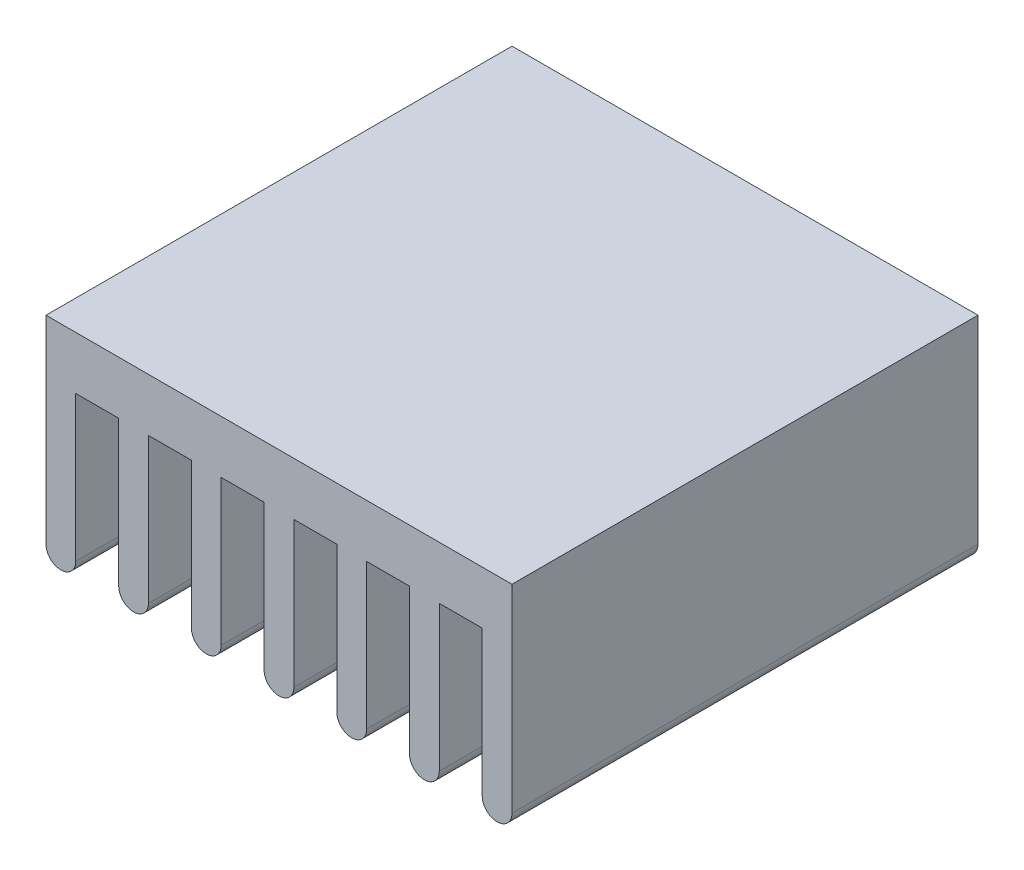
ISO-10303-21;
HEADER;
FILE_DESCRIPTION(('STEP AP214'),'2;1');
FILE_NAME('part.step','',(''),(''),'','','');
FILE_SCHEMA(('AUTOMOTIVE_DESIGN { 1 0 10303 214 1 1 1 1 }'));
ENDSEC;
DATA;
#1=APPLICATION_CONTEXT('core data for automotive mechanical design processes');
#2=APPLICATION_PROTOCOL_DEFINITION('international standard','automotive_design',2000,#1);
#3=PRODUCT_CONTEXT('',#1,'mechanical');
#4=PRODUCT('Part','Part','',(#3));
#5=PRODUCT_RELATED_PRODUCT_CATEGORY('part','',(#4));
#6=PRODUCT_DEFINITION_FORMATION('','',#4);
#7=PRODUCT_DEFINITION_CONTEXT('part definition',#1,'design');
#8=PRODUCT_DEFINITION('design','',#6,#7);
#9=PRODUCT_DEFINITION_SHAPE('','',#8);
#10=(LENGTH_UNIT() NAMED_UNIT(*) SI_UNIT(.MILLI.,.METRE.));
#11=(NAMED_UNIT(*) PLANE_ANGLE_UNIT() SI_UNIT($,.RADIAN.));
#12=(NAMED_UNIT(*) SI_UNIT($,.STERADIAN.) SOLID_ANGLE_UNIT());
#13=UNCERTAINTY_MEASURE_WITH_UNIT(LENGTH_MEASURE(1.E-05),#10,'distance_accuracy_value','');
#14=(GEOMETRIC_REPRESENTATION_CONTEXT(3) GLOBAL_UNCERTAINTY_ASSIGNED_CONTEXT((#13)) GLOBAL_UNIT_ASSIGNED_CONTEXT((#10,
#11,#12)) REPRESENTATION_CONTEXT('',''));
#15=CARTESIAN_POINT('',(0.,0.,0.));
#16=DIRECTION('',(0.,0.,1.));
#17=DIRECTION('',(1.,0.,0.));
#18=AXIS2_PLACEMENT_3D('',#15,#16,#17);
#19=CARTESIAN_POINT('',(0.,0.,14.1));
#20=DIRECTION('',(1.,0.,0.));
#21=DIRECTION('',(0.,1.,0.));
#22=AXIS2_PLACEMENT_3D('',#19,#20,#21);
#23=PLANE('',#22);
#24=DIRECTION('',(0.,-1.,0.));
#25=VECTOR('',#24,1.);
#26=CARTESIAN_POINT('',(0.,0.,0.));
#27=LINE('',#26,#25);
#28=CARTESIAN_POINT('',(0.,0.,0.));
#29=VERTEX_POINT('',#28);
#30=CARTESIAN_POINT('',(0.,-6.,0.));
#31=VERTEX_POINT('',#30);
#32=EDGE_CURVE('E249',#29,#31,#27,.T.);
#33=ORIENTED_EDGE('',*,*,#32,.T.);
#34=DIRECTION('',(0.,0.,-1.));
#35=VECTOR('',#34,1.);
#36=CARTESIAN_POINT('',(0.,-6.,14.1));
#37=LINE('',#36,#35);
#38=CARTESIAN_POINT('',(0.,-6.,14.1));
#39=VERTEX_POINT('',#38);
#40=EDGE_CURVE('E11',#39,#31,#37,.T.);
#41=ORIENTED_EDGE('',*,*,#40,.F.);
#42=DIRECTION('',(0.,-1.,0.));
#43=VECTOR('',#42,1.);
#44=CARTESIAN_POINT('',(0.,0.,14.1));
#45=LINE('',#44,#43);
#46=CARTESIAN_POINT('',(0.,0.,14.1));
#47=VERTEX_POINT('',#46);
#48=EDGE_CURVE('E303',#47,#39,#45,.T.);
#49=ORIENTED_EDGE('',*,*,#48,.F.);
#50=DIRECTION('',(0.,0.,-1.));
#51=VECTOR('',#50,1.);
#52=CARTESIAN_POINT('',(0.,0.,14.1));
#53=LINE('',#52,#51);
#54=EDGE_CURVE('E245',#47,#29,#53,.T.);
#55=ORIENTED_EDGE('',*,*,#54,.T.);
#56=EDGE_LOOP('',(#33,#41,#49,#55));
#57=FACE_BOUND('',#56,.T.);
#58=ADVANCED_FACE('F33',(#57),#23,.F.);
#59=CARTESIAN_POINT('',(0.450000000000001,-6.,14.1));
#60=DIRECTION('',(0.,0.,-1.));
#61=DIRECTION('',(-1.,0.,0.));
#62=AXIS2_PLACEMENT_3D('',#59,#60,#61);
#63=CYLINDRICAL_SURFACE('',#62,0.45);
#64=CARTESIAN_POINT('',(0.450000000000001,-6.,0.));
#65=DIRECTION('',(0.,0.,1.));
#66=DIRECTION('',(1.,0.,0.));
#67=AXIS2_PLACEMENT_3D('',#64,#65,#66);
#68=CIRCLE('',#67,0.45);
#69=CARTESIAN_POINT('',(0.900000000000001,-6.,0.));
#70=VERTEX_POINT('',#69);
#71=EDGE_CURVE('E252',#31,#70,#68,.T.);
#72=ORIENTED_EDGE('',*,*,#71,.T.);
#73=DIRECTION('',(0.,0.,-1.));
#74=VECTOR('',#73,1.);
#75=CARTESIAN_POINT('',(0.900000000000001,-6.,14.1));
#76=LINE('',#75,#74);
#77=CARTESIAN_POINT('',(0.900000000000001,-6.,14.1));
#78=VERTEX_POINT('',#77);
#79=EDGE_CURVE('E41',#78,#70,#76,.T.);
#80=ORIENTED_EDGE('',*,*,#79,.F.);
#81=CARTESIAN_POINT('',(0.450000000000001,-6.,14.1));
#82=DIRECTION('',(0.,0.,1.));
#83=DIRECTION('',(1.,0.,0.));
#84=AXIS2_PLACEMENT_3D('',#81,#82,#83);
#85=CIRCLE('',#84,0.45);
#86=EDGE_CURVE('E152',#39,#78,#85,.T.);
#87=ORIENTED_EDGE('',*,*,#86,.F.);
#88=ORIENTED_EDGE('',*,*,#40,.T.);
#89=EDGE_LOOP('',(#72,#80,#87,#88));
#90=FACE_BOUND('',#89,.T.);
#91=ADVANCED_FACE('F461',(#90),#63,.T.);
#92=CARTESIAN_POINT('',(0.9,-1.6,14.1));
#93=DIRECTION('',(-1.,0.,0.));
#94=DIRECTION('',(0.,-1.,0.));
#95=AXIS2_PLACEMENT_3D('',#92,#93,#94);
#96=PLANE('',#95);
#97=DIRECTION('',(0.,1.,0.));
#98=VECTOR('',#97,1.);
#99=CARTESIAN_POINT('',(0.9,-1.6,0.));
#100=LINE('',#99,#98);
#101=CARTESIAN_POINT('',(0.9,-1.6,0.));
#102=VERTEX_POINT('',#101);
#103=EDGE_CURVE('E254',#70,#102,#100,.T.);
#104=ORIENTED_EDGE('',*,*,#103,.T.);
#105=DIRECTION('',(0.,0.,-1.));
#106=VECTOR('',#105,1.);
#107=CARTESIAN_POINT('',(0.9,-1.6,14.1));
#108=LINE('',#107,#106);
#109=CARTESIAN_POINT('',(0.9,-1.6,14.1));
#110=VERTEX_POINT('',#109);
#111=EDGE_CURVE('E370',#110,#102,#108,.T.);
#112=ORIENTED_EDGE('',*,*,#111,.F.);
#113=DIRECTION('',(0.,1.,0.));
#114=VECTOR('',#113,1.);
#115=CARTESIAN_POINT('',(0.9,-1.6,14.1));
#116=LINE('',#115,#114);
#117=EDGE_CURVE('E378',#78,#110,#116,.T.);
#118=ORIENTED_EDGE('',*,*,#117,.F.);
#119=ORIENTED_EDGE('',*,*,#79,.T.);
#120=EDGE_LOOP('',(#104,#112,#118,#119));
#121=FACE_BOUND('',#120,.T.);
#122=ADVANCED_FACE('F376',(#121),#96,.F.);
#123=CARTESIAN_POINT('',(0.9,-1.6,14.1));
#124=DIRECTION('',(0.,1.,0.));
#125=DIRECTION('',(0.,0.,1.));
#126=AXIS2_PLACEMENT_3D('',#123,#124,#125);
#127=PLANE('',#126);
#128=DIRECTION('',(1.,0.,0.));
#129=VECTOR('',#128,1.);
#130=CARTESIAN_POINT('',(0.9,-1.6,0.));
#131=LINE('',#130,#129);
#132=CARTESIAN_POINT('',(2.2,-1.6,0.));
#133=VERTEX_POINT('',#132);
#134=EDGE_CURVE('E256',#102,#133,#131,.T.);
#135=ORIENTED_EDGE('',*,*,#134,.T.);
#136=DIRECTION('',(0.,0.,-1.));
#137=VECTOR('',#136,1.);
#138=CARTESIAN_POINT('',(2.2,-1.6,14.1));
#139=LINE('',#138,#137);
#140=CARTESIAN_POINT('',(2.2,-1.6,14.1));
#141=VERTEX_POINT('',#140);
#142=EDGE_CURVE('E367',#141,#133,#139,.T.);
#143=ORIENTED_EDGE('',*,*,#142,.F.);
#144=DIRECTION('',(1.,0.,0.));
#145=VECTOR('',#144,1.);
#146=CARTESIAN_POINT('',(0.9,-1.6,14.1));
#147=LINE('',#146,#145);
#148=EDGE_CURVE('E396',#110,#141,#147,.T.);
#149=ORIENTED_EDGE('',*,*,#148,.F.);
#150=ORIENTED_EDGE('',*,*,#111,.T.);
#151=EDGE_LOOP('',(#135,#143,#149,#150));
#152=FACE_BOUND('',#151,.T.);
#153=ADVANCED_FACE('F387',(#152),#127,.F.);
#154=CARTESIAN_POINT('',(2.2,-1.6,14.1));
#155=DIRECTION('',(1.,0.,0.));
#156=DIRECTION('',(0.,1.,0.));
#157=AXIS2_PLACEMENT_3D('',#154,#155,#156);
#158=PLANE('',#157);
#159=DIRECTION('',(0.,-1.,0.));
#160=VECTOR('',#159,1.);
#161=CARTESIAN_POINT('',(2.2,-1.6,0.));
#162=LINE('',#161,#160);
#163=CARTESIAN_POINT('',(2.2,-6.,0.));
#164=VERTEX_POINT('',#163);
#165=EDGE_CURVE('E258',#133,#164,#162,.T.);
#166=ORIENTED_EDGE('',*,*,#165,.T.);
#167=DIRECTION('',(0.,0.,-1.));
#168=VECTOR('',#167,1.);
#169=CARTESIAN_POINT('',(2.2,-6.,14.1));
#170=LINE('',#169,#168);
#171=CARTESIAN_POINT('',(2.2,-6.,14.1));
#172=VERTEX_POINT('',#171);
#173=EDGE_CURVE('E364',#172,#164,#170,.T.);
#174=ORIENTED_EDGE('',*,*,#173,.F.);
#175=DIRECTION('',(0.,-1.,0.));
#176=VECTOR('',#175,1.);
#177=CARTESIAN_POINT('',(2.2,-1.6,14.1));
#178=LINE('',#177,#176);
#179=EDGE_CURVE('E393',#141,#172,#178,.T.);
#180=ORIENTED_EDGE('',*,*,#179,.F.);
#181=ORIENTED_EDGE('',*,*,#142,.T.);
#182=EDGE_LOOP('',(#166,#174,#180,#181));
#183=FACE_BOUND('',#182,.T.);
#184=ADVANCED_FACE('F391',(#183),#158,.F.);
#185=CARTESIAN_POINT('',(2.65,-6.,14.1));
#186=DIRECTION('',(0.,0.,-1.));
#187=DIRECTION('',(-1.,0.,0.));
#188=AXIS2_PLACEMENT_3D('',#185,#186,#187);
#189=CYLINDRICAL_SURFACE('',#188,0.45);
#190=CARTESIAN_POINT('',(2.65,-6.,0.));
#191=DIRECTION('',(0.,0.,1.));
#192=DIRECTION('',(1.,0.,0.));
#193=AXIS2_PLACEMENT_3D('',#190,#191,#192);
#194=CIRCLE('',#193,0.45);
#195=CARTESIAN_POINT('',(3.1,-6.,0.));
#196=VERTEX_POINT('',#195);
#197=EDGE_CURVE('E260',#164,#196,#194,.T.);
#198=ORIENTED_EDGE('',*,*,#197,.T.);
#199=DIRECTION('',(0.,0.,-1.));
#200=VECTOR('',#199,1.);
#201=CARTESIAN_POINT('',(3.1,-6.,14.1));
#202=LINE('',#201,#200);
#203=CARTESIAN_POINT('',(3.1,-6.,14.1));
#204=VERTEX_POINT('',#203);
#205=EDGE_CURVE('E361',#204,#196,#202,.T.);
#206=ORIENTED_EDGE('',*,*,#205,.F.);
#207=CARTESIAN_POINT('',(2.65,-6.,14.1));
#208=DIRECTION('',(0.,0.,1.));
#209=DIRECTION('',(1.,0.,0.));
#210=AXIS2_PLACEMENT_3D('',#207,#208,#209);
#211=CIRCLE('',#210,0.45);
#212=EDGE_CURVE('E395',#172,#204,#211,.T.);
#213=ORIENTED_EDGE('',*,*,#212,.F.);
#214=ORIENTED_EDGE('',*,*,#173,.T.);
#215=EDGE_LOOP('',(#198,#206,#213,#214));
#216=FACE_BOUND('',#215,.T.);
#217=ADVANCED_FACE('F474',(#216),#189,.T.);
#218=CARTESIAN_POINT('',(3.1,-6.,14.1));
#219=DIRECTION('',(-1.,0.,0.));
#220=DIRECTION('',(0.,0.,1.));
#221=AXIS2_PLACEMENT_3D('',#218,#219,#220);
#222=PLANE('',#221);
#223=DIRECTION('',(0.,1.,0.));
#224=VECTOR('',#223,1.);
#225=CARTESIAN_POINT('',(3.1,-6.,0.));
#226=LINE('',#225,#224);
#227=CARTESIAN_POINT('',(3.1,-1.6,0.));
#228=VERTEX_POINT('',#227);
#229=EDGE_CURVE('E262',#196,#228,#226,.T.);
#230=ORIENTED_EDGE('',*,*,#229,.T.);
#231=DIRECTION('',(0.,0.,-1.));
#232=VECTOR('',#231,1.);
#233=CARTESIAN_POINT('',(3.1,-1.6,14.1));
#234=LINE('',#233,#232);
#235=CARTESIAN_POINT('',(3.1,-1.6,14.1));
#236=VERTEX_POINT('',#235);
#237=EDGE_CURVE('E358',#236,#228,#234,.T.);
#238=ORIENTED_EDGE('',*,*,#237,.F.);
#239=DIRECTION('',(0.,1.,0.));
#240=VECTOR('',#239,1.);
#241=CARTESIAN_POINT('',(3.1,-6.,14.1));
#242=LINE('',#241,#240);
#243=EDGE_CURVE('E398',#204,#236,#242,.T.);
#244=ORIENTED_EDGE('',*,*,#243,.F.);
#245=ORIENTED_EDGE('',*,*,#205,.T.);
#246=EDGE_LOOP('',(#230,#238,#244,#245));
#247=FACE_BOUND('',#246,.T.);
#248=ADVANCED_FACE('F477',(#247),#222,.F.);
#249=CARTESIAN_POINT('',(3.1,-1.6,14.1));
#250=DIRECTION('',(0.,1.,0.));
#251=DIRECTION('',(0.,0.,1.));
#252=AXIS2_PLACEMENT_3D('',#249,#250,#251);
#253=PLANE('',#252);
#254=DIRECTION('',(1.,0.,0.));
#255=VECTOR('',#254,1.);
#256=CARTESIAN_POINT('',(3.1,-1.6,0.));
#257=LINE('',#256,#255);
#258=CARTESIAN_POINT('',(4.4,-1.6,0.));
#259=VERTEX_POINT('',#258);
#260=EDGE_CURVE('E264',#228,#259,#257,.T.);
#261=ORIENTED_EDGE('',*,*,#260,.T.);
#262=DIRECTION('',(0.,0.,-1.));
#263=VECTOR('',#262,1.);
#264=CARTESIAN_POINT('',(4.4,-1.6,14.1));
#265=LINE('',#264,#263);
#266=CARTESIAN_POINT('',(4.4,-1.6,14.1));
#267=VERTEX_POINT('',#266);
#268=EDGE_CURVE('E355',#267,#259,#265,.T.);
#269=ORIENTED_EDGE('',*,*,#268,.F.);
#270=DIRECTION('',(1.,0.,0.));
#271=VECTOR('',#270,1.);
#272=CARTESIAN_POINT('',(3.1,-1.6,14.1));
#273=LINE('',#272,#271);
#274=EDGE_CURVE('E404',#236,#267,#273,.T.);
#275=ORIENTED_EDGE('',*,*,#274,.F.);
#276=ORIENTED_EDGE('',*,*,#237,.T.);
#277=EDGE_LOOP('',(#261,#269,#275,#276));
#278=FACE_BOUND('',#277,.T.);
#279=ADVANCED_FACE('F481',(#278),#253,.F.);
#280=CARTESIAN_POINT('',(4.4,-1.6,14.1));
#281=DIRECTION('',(1.,0.,0.));
#282=DIRECTION('',(0.,1.,0.));
#283=AXIS2_PLACEMENT_3D('',#280,#281,#282);
#284=PLANE('',#283);
#285=DIRECTION('',(0.,-1.,0.));
#286=VECTOR('',#285,1.);
#287=CARTESIAN_POINT('',(4.4,-1.6,0.));
#288=LINE('',#287,#286);
#289=CARTESIAN_POINT('',(4.4,-6.,0.));
#290=VERTEX_POINT('',#289);
#291=EDGE_CURVE('E266',#259,#290,#288,.T.);
#292=ORIENTED_EDGE('',*,*,#291,.T.);
#293=DIRECTION('',(0.,0.,-1.));
#294=VECTOR('',#293,1.);
#295=CARTESIAN_POINT('',(4.4,-6.,14.1));
#296=LINE('',#295,#294);
#297=CARTESIAN_POINT('',(4.4,-6.,14.1));
#298=VERTEX_POINT('',#297);
#299=EDGE_CURVE('E352',#298,#290,#296,.T.);
#300=ORIENTED_EDGE('',*,*,#299,.F.);
#301=DIRECTION('',(0.,-1.,0.));
#302=VECTOR('',#301,1.);
#303=CARTESIAN_POINT('',(4.4,-1.6,14.1));
#304=LINE('',#303,#302);
#305=EDGE_CURVE('E406',#267,#298,#304,.T.);
#306=ORIENTED_EDGE('',*,*,#305,.F.);
#307=ORIENTED_EDGE('',*,*,#268,.T.);
#308=EDGE_LOOP('',(#292,#300,#306,#307));
#309=FACE_BOUND('',#308,.T.);
#310=ADVANCED_FACE('F485',(#309),#284,.F.);
#311=CARTESIAN_POINT('',(4.85,-6.,14.1));
#312=DIRECTION('',(0.,0.,-1.));
#313=DIRECTION('',(-1.,0.,0.));
#314=AXIS2_PLACEMENT_3D('',#311,#312,#313);
#315=CYLINDRICAL_SURFACE('',#314,0.449999999999999);
#316=CARTESIAN_POINT('',(4.85,-6.,0.));
#317=DIRECTION('',(0.,0.,1.));
#318=DIRECTION('',(1.,0.,0.));
#319=AXIS2_PLACEMENT_3D('',#316,#317,#318);
#320=CIRCLE('',#319,0.449999999999999);
#321=CARTESIAN_POINT('',(5.3,-6.,0.));
#322=VERTEX_POINT('',#321);
#323=EDGE_CURVE('E268',#290,#322,#320,.T.);
#324=ORIENTED_EDGE('',*,*,#323,.T.);
#325=DIRECTION('',(0.,0.,-1.));
#326=VECTOR('',#325,1.);
#327=CARTESIAN_POINT('',(5.3,-6.,14.1));
#328=LINE('',#327,#326);
#329=CARTESIAN_POINT('',(5.3,-6.,14.1));
#330=VERTEX_POINT('',#329);
#331=EDGE_CURVE('E349',#330,#322,#328,.T.);
#332=ORIENTED_EDGE('',*,*,#331,.F.);
#333=CARTESIAN_POINT('',(4.85,-6.,14.1));
#334=DIRECTION('',(0.,0.,1.));
#335=DIRECTION('',(1.,0.,0.));
#336=AXIS2_PLACEMENT_3D('',#333,#334,#335);
#337=CIRCLE('',#336,0.449999999999999);
#338=EDGE_CURVE('E408',#298,#330,#337,.T.);
#339=ORIENTED_EDGE('',*,*,#338,.F.);
#340=ORIENTED_EDGE('',*,*,#299,.T.);
#341=EDGE_LOOP('',(#324,#332,#339,#340));
#342=FACE_BOUND('',#341,.T.);
#343=ADVANCED_FACE('F489',(#342),#315,.T.);
#344=CARTESIAN_POINT('',(5.3,-6.,14.1));
#345=DIRECTION('',(-1.,0.,0.));
#346=DIRECTION('',(0.,0.,1.));
#347=AXIS2_PLACEMENT_3D('',#344,#345,#346);
#348=PLANE('',#347);
#349=DIRECTION('',(0.,1.,0.));
#350=VECTOR('',#349,1.);
#351=CARTESIAN_POINT('',(5.3,-6.,0.));
#352=LINE('',#351,#350);
#353=CARTESIAN_POINT('',(5.3,-1.6,0.));
#354=VERTEX_POINT('',#353);
#355=EDGE_CURVE('E270',#322,#354,#352,.T.);
#356=ORIENTED_EDGE('',*,*,#355,.T.);
#357=DIRECTION('',(0.,0.,-1.));
#358=VECTOR('',#357,1.);
#359=CARTESIAN_POINT('',(5.3,-1.6,14.1));
#360=LINE('',#359,#358);
#361=CARTESIAN_POINT('',(5.3,-1.6,14.1));
#362=VERTEX_POINT('',#361);
#363=EDGE_CURVE('E346',#362,#354,#360,.T.);
#364=ORIENTED_EDGE('',*,*,#363,.F.);
#365=DIRECTION('',(0.,1.,0.));
#366=VECTOR('',#365,1.);
#367=CARTESIAN_POINT('',(5.3,-6.,14.1));
#368=LINE('',#367,#366);
#369=EDGE_CURVE('E410',#330,#362,#368,.T.);
#370=ORIENTED_EDGE('',*,*,#369,.F.);
#371=ORIENTED_EDGE('',*,*,#331,.T.);
#372=EDGE_LOOP('',(#356,#364,#370,#371));
#373=FACE_BOUND('',#372,.T.);
#374=ADVANCED_FACE('F493',(#373),#348,.F.);
#375=CARTESIAN_POINT('',(5.3,-1.6,14.1));
#376=DIRECTION('',(0.,1.,0.));
#377=DIRECTION('',(0.,0.,1.));
#378=AXIS2_PLACEMENT_3D('',#375,#376,#377);
#379=PLANE('',#378);
#380=DIRECTION('',(1.,0.,0.));
#381=VECTOR('',#380,1.);
#382=CARTESIAN_POINT('',(5.3,-1.6,0.));
#383=LINE('',#382,#381);
#384=CARTESIAN_POINT('',(6.6,-1.6,0.));
#385=VERTEX_POINT('',#384);
#386=EDGE_CURVE('E272',#354,#385,#383,.T.);
#387=ORIENTED_EDGE('',*,*,#386,.T.);
#388=DIRECTION('',(0.,0.,-1.));
#389=VECTOR('',#388,1.);
#390=CARTESIAN_POINT('',(6.6,-1.6,14.1));
#391=LINE('',#390,#389);
#392=CARTESIAN_POINT('',(6.6,-1.6,14.1));
#393=VERTEX_POINT('',#392);
#394=EDGE_CURVE('E343',#393,#385,#391,.T.);
#395=ORIENTED_EDGE('',*,*,#394,.F.);
#396=DIRECTION('',(1.,0.,0.));
#397=VECTOR('',#396,1.);
#398=CARTESIAN_POINT('',(5.3,-1.6,14.1));
#399=LINE('',#398,#397);
#400=EDGE_CURVE('E412',#362,#393,#399,.T.);
#401=ORIENTED_EDGE('',*,*,#400,.F.);
#402=ORIENTED_EDGE('',*,*,#363,.T.);
#403=EDGE_LOOP('',(#387,#395,#401,#402));
#404=FACE_BOUND('',#403,.T.);
#405=ADVANCED_FACE('F497',(#404),#379,.F.);
#406=CARTESIAN_POINT('',(6.6,-1.6,14.1));
#407=DIRECTION('',(1.,0.,0.));
#408=DIRECTION('',(0.,0.,-1.));
#409=AXIS2_PLACEMENT_3D('',#406,#407,#408);
#410=PLANE('',#409);
#411=DIRECTION('',(0.,-1.,0.));
#412=VECTOR('',#411,1.);
#413=CARTESIAN_POINT('',(6.6,-1.6,0.));
#414=LINE('',#413,#412);
#415=CARTESIAN_POINT('',(6.6,-6.,0.));
#416=VERTEX_POINT('',#415);
#417=EDGE_CURVE('E274',#385,#416,#414,.T.);
#418=ORIENTED_EDGE('',*,*,#417,.T.);
#419=DIRECTION('',(0.,0.,-1.));
#420=VECTOR('',#419,1.);
#421=CARTESIAN_POINT('',(6.6,-6.,14.1));
#422=LINE('',#421,#420);
#423=CARTESIAN_POINT('',(6.6,-6.,14.1));
#424=VERTEX_POINT('',#423);
#425=EDGE_CURVE('E340',#424,#416,#422,.T.);
#426=ORIENTED_EDGE('',*,*,#425,.F.);
#427=DIRECTION('',(0.,-1.,0.));
#428=VECTOR('',#427,1.);
#429=CARTESIAN_POINT('',(6.6,-1.6,14.1));
#430=LINE('',#429,#428);
#431=EDGE_CURVE('E414',#393,#424,#430,.T.);
#432=ORIENTED_EDGE('',*,*,#431,.F.);
#433=ORIENTED_EDGE('',*,*,#394,.T.);
#434=EDGE_LOOP('',(#418,#426,#432,#433));
#435=FACE_BOUND('',#434,.T.);
#436=ADVANCED_FACE('F501',(#435),#410,.F.);
#437=CARTESIAN_POINT('',(7.05,-6.,14.1));
#438=DIRECTION('',(0.,0.,-1.));
#439=DIRECTION('',(-1.,0.,0.));
#440=AXIS2_PLACEMENT_3D('',#437,#438,#439);
#441=CYLINDRICAL_SURFACE('',#440,0.45);
#442=CARTESIAN_POINT('',(7.05,-6.,0.));
#443=DIRECTION('',(0.,0.,1.));
#444=DIRECTION('',(1.,0.,0.));
#445=AXIS2_PLACEMENT_3D('',#442,#443,#444);
#446=CIRCLE('',#445,0.45);
#447=CARTESIAN_POINT('',(7.5,-6.,0.));
#448=VERTEX_POINT('',#447);
#449=EDGE_CURVE('E276',#416,#448,#446,.T.);
#450=ORIENTED_EDGE('',*,*,#449,.T.);
#451=DIRECTION('',(0.,0.,-1.));
#452=VECTOR('',#451,1.);
#453=CARTESIAN_POINT('',(7.5,-6.,14.1));
#454=LINE('',#453,#452);
#455=CARTESIAN_POINT('',(7.5,-6.,14.1));
#456=VERTEX_POINT('',#455);
#457=EDGE_CURVE('E337',#456,#448,#454,.T.);
#458=ORIENTED_EDGE('',*,*,#457,.F.);
#459=CARTESIAN_POINT('',(7.05,-6.,14.1));
#460=DIRECTION('',(0.,0.,1.));
#461=DIRECTION('',(1.,0.,0.));
#462=AXIS2_PLACEMENT_3D('',#459,#460,#461);
#463=CIRCLE('',#462,0.45);
#464=EDGE_CURVE('E416',#424,#456,#463,.T.);
#465=ORIENTED_EDGE('',*,*,#464,.F.);
#466=ORIENTED_EDGE('',*,*,#425,.T.);
#467=EDGE_LOOP('',(#450,#458,#465,#466));
#468=FACE_BOUND('',#467,.T.);
#469=ADVANCED_FACE('F505',(#468),#441,.T.);
#470=CARTESIAN_POINT('',(7.5,-6.,14.1));
#471=DIRECTION('',(-1.,0.,0.));
#472=DIRECTION('',(0.,0.,1.));
#473=AXIS2_PLACEMENT_3D('',#470,#471,#472);
#474=PLANE('',#473);
#475=DIRECTION('',(0.,1.,0.));
#476=VECTOR('',#475,1.);
#477=CARTESIAN_POINT('',(7.5,-6.,0.));
#478=LINE('',#477,#476);
#479=CARTESIAN_POINT('',(7.5,-1.6,0.));
#480=VERTEX_POINT('',#479);
#481=EDGE_CURVE('E278',#448,#480,#478,.T.);
#482=ORIENTED_EDGE('',*,*,#481,.T.);
#483=DIRECTION('',(0.,0.,-1.));
#484=VECTOR('',#483,1.);
#485=CARTESIAN_POINT('',(7.5,-1.6,14.1));
#486=LINE('',#485,#484);
#487=CARTESIAN_POINT('',(7.5,-1.6,14.1));
#488=VERTEX_POINT('',#487);
#489=EDGE_CURVE('E334',#488,#480,#486,.T.);
#490=ORIENTED_EDGE('',*,*,#489,.F.);
#491=DIRECTION('',(0.,1.,0.));
#492=VECTOR('',#491,1.);
#493=CARTESIAN_POINT('',(7.5,-6.,14.1));
#494=LINE('',#493,#492);
#495=EDGE_CURVE('E418',#456,#488,#494,.T.);
#496=ORIENTED_EDGE('',*,*,#495,.F.);
#497=ORIENTED_EDGE('',*,*,#457,.T.);
#498=EDGE_LOOP('',(#482,#490,#496,#497));
#499=FACE_BOUND('',#498,.T.);
#500=ADVANCED_FACE('F509',(#499),#474,.F.);
#501=CARTESIAN_POINT('',(7.5,-1.6,14.1));
#502=DIRECTION('',(0.,1.,0.));
#503=DIRECTION('',(0.,0.,1.));
#504=AXIS2_PLACEMENT_3D('',#501,#502,#503);
#505=PLANE('',#504);
#506=DIRECTION('',(1.,0.,0.));
#507=VECTOR('',#506,1.);
#508=CARTESIAN_POINT('',(7.5,-1.6,0.));
#509=LINE('',#508,#507);
#510=CARTESIAN_POINT('',(8.8,-1.6,0.));
#511=VERTEX_POINT('',#510);
#512=EDGE_CURVE('E280',#480,#511,#509,.T.);
#513=ORIENTED_EDGE('',*,*,#512,.T.);
#514=DIRECTION('',(0.,0.,-1.));
#515=VECTOR('',#514,1.);
#516=CARTESIAN_POINT('',(8.8,-1.6,14.1));
#517=LINE('',#516,#515);
#518=CARTESIAN_POINT('',(8.8,-1.6,14.1));
#519=VERTEX_POINT('',#518);
#520=EDGE_CURVE('E331',#519,#511,#517,.T.);
#521=ORIENTED_EDGE('',*,*,#520,.F.);
#522=DIRECTION('',(1.,0.,0.));
#523=VECTOR('',#522,1.);
#524=CARTESIAN_POINT('',(7.5,-1.6,14.1));
#525=LINE('',#524,#523);
#526=EDGE_CURVE('E420',#488,#519,#525,.T.);
#527=ORIENTED_EDGE('',*,*,#526,.F.);
#528=ORIENTED_EDGE('',*,*,#489,.T.);
#529=EDGE_LOOP('',(#513,#521,#527,#528));
#530=FACE_BOUND('',#529,.T.);
#531=ADVANCED_FACE('F513',(#530),#505,.F.);
#532=CARTESIAN_POINT('',(8.8,-1.6,14.1));
#533=DIRECTION('',(1.,0.,0.));
#534=DIRECTION('',(0.,0.,-1.));
#535=AXIS2_PLACEMENT_3D('',#532,#533,#534);
#536=PLANE('',#535);
#537=DIRECTION('',(0.,-1.,0.));
#538=VECTOR('',#537,1.);
#539=CARTESIAN_POINT('',(8.8,-1.6,0.));
#540=LINE('',#539,#538);
#541=CARTESIAN_POINT('',(8.8,-6.,0.));
#542=VERTEX_POINT('',#541);
#543=EDGE_CURVE('E282',#511,#542,#540,.T.);
#544=ORIENTED_EDGE('',*,*,#543,.T.);
#545=DIRECTION('',(0.,0.,-1.));
#546=VECTOR('',#545,1.);
#547=CARTESIAN_POINT('',(8.8,-6.,14.1));
#548=LINE('',#547,#546);
#549=CARTESIAN_POINT('',(8.8,-6.,14.1));
#550=VERTEX_POINT('',#549);
#551=EDGE_CURVE('E328',#550,#542,#548,.T.);
#552=ORIENTED_EDGE('',*,*,#551,.F.);
#553=DIRECTION('',(0.,-1.,0.));
#554=VECTOR('',#553,1.);
#555=CARTESIAN_POINT('',(8.8,-1.6,14.1));
#556=LINE('',#555,#554);
#557=EDGE_CURVE('E422',#519,#550,#556,.T.);
#558=ORIENTED_EDGE('',*,*,#557,.F.);
#559=ORIENTED_EDGE('',*,*,#520,.T.);
#560=EDGE_LOOP('',(#544,#552,#558,#559));
#561=FACE_BOUND('',#560,.T.);
#562=ADVANCED_FACE('F517',(#561),#536,.F.);
#563=CARTESIAN_POINT('',(9.24940529191601,-6.,14.1));
#564=DIRECTION('',(0.,0.,-1.));
#565=DIRECTION('',(-1.,0.,0.));
#566=AXIS2_PLACEMENT_3D('',#563,#564,#565);
#567=CYLINDRICAL_SURFACE('',#566,0.44940529191601);
#568=CARTESIAN_POINT('',(9.24940529191601,-6.,0.));
#569=DIRECTION('',(0.,0.,1.));
#570=DIRECTION('',(1.,0.,0.));
#571=AXIS2_PLACEMENT_3D('',#568,#569,#570);
#572=CIRCLE('',#571,0.44940529191601);
#573=CARTESIAN_POINT('',(9.69881058383202,-6.,0.));
#574=VERTEX_POINT('',#573);
#575=EDGE_CURVE('E284',#542,#574,#572,.T.);
#576=ORIENTED_EDGE('',*,*,#575,.T.);
#577=DIRECTION('',(0.,0.,-1.));
#578=VECTOR('',#577,1.);
#579=CARTESIAN_POINT('',(9.69881058383202,-6.,14.1));
#580=LINE('',#579,#578);
#581=CARTESIAN_POINT('',(9.69881058383202,-6.,14.1));
#582=VERTEX_POINT('',#581);
#583=EDGE_CURVE('E325',#582,#574,#580,.T.);
#584=ORIENTED_EDGE('',*,*,#583,.F.);
#585=CARTESIAN_POINT('',(9.24940529191601,-6.,14.1));
#586=DIRECTION('',(0.,0.,1.));
#587=DIRECTION('',(1.,0.,0.));
#588=AXIS2_PLACEMENT_3D('',#585,#586,#587);
#589=CIRCLE('',#588,0.44940529191601);
#590=EDGE_CURVE('E424',#550,#582,#589,.T.);
#591=ORIENTED_EDGE('',*,*,#590,.F.);
#592=ORIENTED_EDGE('',*,*,#551,.T.);
#593=EDGE_LOOP('',(#576,#584,#591,#592));
#594=FACE_BOUND('',#593,.T.);
#595=ADVANCED_FACE('F521',(#594),#567,.T.);
#596=CARTESIAN_POINT('',(9.69881058383202,-6.,14.1));
#597=DIRECTION('',(-1.,0.,0.));
#598=DIRECTION('',(0.,0.,1.));
#599=AXIS2_PLACEMENT_3D('',#596,#597,#598);
#600=PLANE('',#599);
#601=DIRECTION('',(0.,1.,0.));
#602=VECTOR('',#601,1.);
#603=CARTESIAN_POINT('',(9.69881058383202,-6.,0.));
#604=LINE('',#603,#602);
#605=CARTESIAN_POINT('',(9.69881058383202,-1.6,0.));
#606=VERTEX_POINT('',#605);
#607=EDGE_CURVE('E286',#574,#606,#604,.T.);
#608=ORIENTED_EDGE('',*,*,#607,.T.);
#609=DIRECTION('',(0.,0.,-1.));
#610=VECTOR('',#609,1.);
#611=CARTESIAN_POINT('',(9.69881058383202,-1.6,14.1));
#612=LINE('',#611,#610);
#613=CARTESIAN_POINT('',(9.69881058383202,-1.6,14.1));
#614=VERTEX_POINT('',#613);
#615=EDGE_CURVE('E322',#614,#606,#612,.T.);
#616=ORIENTED_EDGE('',*,*,#615,.F.);
#617=DIRECTION('',(0.,1.,0.));
#618=VECTOR('',#617,1.);
#619=CARTESIAN_POINT('',(9.69881058383202,-6.,14.1));
#620=LINE('',#619,#618);
#621=EDGE_CURVE('E426',#582,#614,#620,.T.);
#622=ORIENTED_EDGE('',*,*,#621,.F.);
#623=ORIENTED_EDGE('',*,*,#583,.T.);
#624=EDGE_LOOP('',(#608,#616,#622,#623));
#625=FACE_BOUND('',#624,.T.);
#626=ADVANCED_FACE('F525',(#625),#600,.F.);
#627=CARTESIAN_POINT('',(9.69881058383202,-1.6,14.1));
#628=DIRECTION('',(0.,1.,0.));
#629=DIRECTION('',(0.,0.,1.));
#630=AXIS2_PLACEMENT_3D('',#627,#628,#629);
#631=PLANE('',#630);
#632=DIRECTION('',(1.,0.,0.));
#633=VECTOR('',#632,1.);
#634=CARTESIAN_POINT('',(9.69881058383202,-1.6,0.));
#635=LINE('',#634,#633);
#636=CARTESIAN_POINT('',(10.998810583832,-1.6,0.));
#637=VERTEX_POINT('',#636);
#638=EDGE_CURVE('E288',#606,#637,#635,.T.);
#639=ORIENTED_EDGE('',*,*,#638,.T.);
#640=DIRECTION('',(0.,0.,-1.));
#641=VECTOR('',#640,1.);
#642=CARTESIAN_POINT('',(10.998810583832,-1.6,14.1));
#643=LINE('',#642,#641);
#644=CARTESIAN_POINT('',(10.998810583832,-1.6,14.1));
#645=VERTEX_POINT('',#644);
#646=EDGE_CURVE('E319',#645,#637,#643,.T.);
#647=ORIENTED_EDGE('',*,*,#646,.F.);
#648=DIRECTION('',(1.,0.,0.));
#649=VECTOR('',#648,1.);
#650=CARTESIAN_POINT('',(9.69881058383202,-1.6,14.1));
#651=LINE('',#650,#649);
#652=EDGE_CURVE('E428',#614,#645,#651,.T.);
#653=ORIENTED_EDGE('',*,*,#652,.F.);
#654=ORIENTED_EDGE('',*,*,#615,.T.);
#655=EDGE_LOOP('',(#639,#647,#653,#654));
#656=FACE_BOUND('',#655,.T.);
#657=ADVANCED_FACE('F529',(#656),#631,.F.);
#658=CARTESIAN_POINT('',(10.998810583832,-1.6,14.1));
#659=DIRECTION('',(1.,0.,0.));
#660=DIRECTION('',(0.,0.,-1.));
#661=AXIS2_PLACEMENT_3D('',#658,#659,#660);
#662=PLANE('',#661);
#663=DIRECTION('',(0.,-1.,0.));
#664=VECTOR('',#663,1.);
#665=CARTESIAN_POINT('',(10.998810583832,-1.6,0.));
#666=LINE('',#665,#664);
#667=CARTESIAN_POINT('',(10.998810583832,-6.,0.));
#668=VERTEX_POINT('',#667);
#669=EDGE_CURVE('E290',#637,#668,#666,.T.);
#670=ORIENTED_EDGE('',*,*,#669,.T.);
#671=DIRECTION('',(0.,0.,-1.));
#672=VECTOR('',#671,1.);
#673=CARTESIAN_POINT('',(10.998810583832,-6.,14.1));
#674=LINE('',#673,#672);
#675=CARTESIAN_POINT('',(10.998810583832,-6.,14.1));
#676=VERTEX_POINT('',#675);
#677=EDGE_CURVE('E316',#676,#668,#674,.T.);
#678=ORIENTED_EDGE('',*,*,#677,.F.);
#679=DIRECTION('',(0.,-1.,0.));
#680=VECTOR('',#679,1.);
#681=CARTESIAN_POINT('',(10.998810583832,-1.6,14.1));
#682=LINE('',#681,#680);
#683=EDGE_CURVE('E430',#645,#676,#682,.T.);
#684=ORIENTED_EDGE('',*,*,#683,.F.);
#685=ORIENTED_EDGE('',*,*,#646,.T.);
#686=EDGE_LOOP('',(#670,#678,#684,#685));
#687=FACE_BOUND('',#686,.T.);
#688=ADVANCED_FACE('F533',(#687),#662,.F.);
#689=CARTESIAN_POINT('',(11.448810583832,-6.,14.1));
#690=DIRECTION('',(0.,0.,-1.));
#691=DIRECTION('',(-1.,0.,0.));
#692=AXIS2_PLACEMENT_3D('',#689,#690,#691);
#693=CYLINDRICAL_SURFACE('',#692,0.45);
#694=CARTESIAN_POINT('',(11.448810583832,-6.,0.));
#695=DIRECTION('',(0.,0.,1.));
#696=DIRECTION('',(1.,0.,0.));
#697=AXIS2_PLACEMENT_3D('',#694,#695,#696);
#698=CIRCLE('',#697,0.45);
#699=CARTESIAN_POINT('',(11.898810583832,-6.,0.));
#700=VERTEX_POINT('',#699);
#701=EDGE_CURVE('E292',#668,#700,#698,.T.);
#702=ORIENTED_EDGE('',*,*,#701,.T.);
#703=DIRECTION('',(0.,0.,-1.));
#704=VECTOR('',#703,1.);
#705=CARTESIAN_POINT('',(11.898810583832,-6.,14.1));
#706=LINE('',#705,#704);
#707=CARTESIAN_POINT('',(11.898810583832,-6.,14.1));
#708=VERTEX_POINT('',#707);
#709=EDGE_CURVE('E313',#708,#700,#706,.T.);
#710=ORIENTED_EDGE('',*,*,#709,.F.);
#711=CARTESIAN_POINT('',(11.448810583832,-6.,14.1));
#712=DIRECTION('',(0.,0.,1.));
#713=DIRECTION('',(1.,0.,0.));
#714=AXIS2_PLACEMENT_3D('',#711,#712,#713);
#715=CIRCLE('',#714,0.45);
#716=EDGE_CURVE('E432',#676,#708,#715,.T.);
#717=ORIENTED_EDGE('',*,*,#716,.F.);
#718=ORIENTED_EDGE('',*,*,#677,.T.);
#719=EDGE_LOOP('',(#702,#710,#717,#718));
#720=FACE_BOUND('',#719,.T.);
#721=ADVANCED_FACE('F537',(#720),#693,.T.);
#722=CARTESIAN_POINT('',(11.898810583832,-6.,14.1));
#723=DIRECTION('',(-1.,0.,0.));
#724=DIRECTION('',(0.,0.,1.));
#725=AXIS2_PLACEMENT_3D('',#722,#723,#724);
#726=PLANE('',#725);
#727=DIRECTION('',(0.,1.,0.));
#728=VECTOR('',#727,1.);
#729=CARTESIAN_POINT('',(11.898810583832,-6.,0.));
#730=LINE('',#729,#728);
#731=CARTESIAN_POINT('',(11.898810583832,-1.6,0.));
#732=VERTEX_POINT('',#731);
#733=EDGE_CURVE('E294',#700,#732,#730,.T.);
#734=ORIENTED_EDGE('',*,*,#733,.T.);
#735=DIRECTION('',(0.,0.,-1.));
#736=VECTOR('',#735,1.);
#737=CARTESIAN_POINT('',(11.898810583832,-1.6,14.1));
#738=LINE('',#737,#736);
#739=CARTESIAN_POINT('',(11.898810583832,-1.6,14.1));
#740=VERTEX_POINT('',#739);
#741=EDGE_CURVE('E310',#740,#732,#738,.T.);
#742=ORIENTED_EDGE('',*,*,#741,.F.);
#743=DIRECTION('',(0.,1.,0.));
#744=VECTOR('',#743,1.);
#745=CARTESIAN_POINT('',(11.898810583832,-6.,14.1));
#746=LINE('',#745,#744);
#747=EDGE_CURVE('E434',#708,#740,#746,.T.);
#748=ORIENTED_EDGE('',*,*,#747,.F.);
#749=ORIENTED_EDGE('',*,*,#709,.T.);
#750=EDGE_LOOP('',(#734,#742,#748,#749));
#751=FACE_BOUND('',#750,.T.);
#752=ADVANCED_FACE('F541',(#751),#726,.F.);
#753=CARTESIAN_POINT('',(11.898810583832,-1.6,14.1));
#754=DIRECTION('',(0.,1.,0.));
#755=DIRECTION('',(-1.,0.,0.));
#756=AXIS2_PLACEMENT_3D('',#753,#754,#755);
#757=PLANE('',#756);
#758=DIRECTION('',(1.,0.,0.));
#759=VECTOR('',#758,1.);
#760=CARTESIAN_POINT('',(11.898810583832,-1.6,0.));
#761=LINE('',#760,#759);
#762=CARTESIAN_POINT('',(13.198810583832,-1.6,0.));
#763=VERTEX_POINT('',#762);
#764=EDGE_CURVE('E296',#732,#763,#761,.T.);
#765=ORIENTED_EDGE('',*,*,#764,.T.);
#766=DIRECTION('',(0.,0.,-1.));
#767=VECTOR('',#766,1.);
#768=CARTESIAN_POINT('',(13.198810583832,-1.6,14.1));
#769=LINE('',#768,#767);
#770=CARTESIAN_POINT('',(13.198810583832,-1.6,14.1));
#771=VERTEX_POINT('',#770);
#772=EDGE_CURVE('E307',#771,#763,#769,.T.);
#773=ORIENTED_EDGE('',*,*,#772,.F.);
#774=DIRECTION('',(1.,0.,0.));
#775=VECTOR('',#774,1.);
#776=CARTESIAN_POINT('',(11.898810583832,-1.6,14.1));
#777=LINE('',#776,#775);
#778=EDGE_CURVE('E436',#740,#771,#777,.T.);
#779=ORIENTED_EDGE('',*,*,#778,.F.);
#780=ORIENTED_EDGE('',*,*,#741,.T.);
#781=EDGE_LOOP('',(#765,#773,#779,#780));
#782=FACE_BOUND('',#781,.T.);
#783=ADVANCED_FACE('F442',(#782),#757,.F.);
#784=CARTESIAN_POINT('',(13.198810583832,-1.6,14.1));
#785=DIRECTION('',(1.,0.,0.));
#786=DIRECTION('',(0.,0.,-1.));
#787=AXIS2_PLACEMENT_3D('',#784,#785,#786);
#788=PLANE('',#787);
#789=DIRECTION('',(0.,-1.,0.));
#790=VECTOR('',#789,1.);
#791=CARTESIAN_POINT('',(13.198810583832,-1.6,0.));
#792=LINE('',#791,#790);
#793=CARTESIAN_POINT('',(13.198810583832,-6.,0.));
#794=VERTEX_POINT('',#793);
#795=EDGE_CURVE('E298',#763,#794,#792,.T.);
#796=ORIENTED_EDGE('',*,*,#795,.T.);
#797=DIRECTION('',(0.,0.,-1.));
#798=VECTOR('',#797,1.);
#799=CARTESIAN_POINT('',(13.198810583832,-6.,14.1));
#800=LINE('',#799,#798);
#801=CARTESIAN_POINT('',(13.198810583832,-6.,14.1));
#802=VERTEX_POINT('',#801);
#803=EDGE_CURVE('E240',#802,#794,#800,.T.);
#804=ORIENTED_EDGE('',*,*,#803,.F.);
#805=DIRECTION('',(0.,-1.,0.));
#806=VECTOR('',#805,1.);
#807=CARTESIAN_POINT('',(13.198810583832,-1.6,14.1));
#808=LINE('',#807,#806);
#809=EDGE_CURVE('E231',#771,#802,#808,.T.);
#810=ORIENTED_EDGE('',*,*,#809,.F.);
#811=ORIENTED_EDGE('',*,*,#772,.T.);
#812=EDGE_LOOP('',(#796,#804,#810,#811));
#813=FACE_BOUND('',#812,.T.);
#814=ADVANCED_FACE('F446',(#813),#788,.F.);
#815=CARTESIAN_POINT('',(13.648810583832,-6.,14.1));
#816=DIRECTION('',(0.,0.,-1.));
#817=DIRECTION('',(-1.,0.,0.));
#818=AXIS2_PLACEMENT_3D('',#815,#816,#817);
#819=CYLINDRICAL_SURFACE('',#818,0.45);
#820=CARTESIAN_POINT('',(13.648810583832,-6.,0.));
#821=DIRECTION('',(0.,0.,1.));
#822=DIRECTION('',(1.,0.,0.));
#823=AXIS2_PLACEMENT_3D('',#820,#821,#822);
#824=CIRCLE('',#823,0.45);
#825=CARTESIAN_POINT('',(14.098810583832,-6.,0.));
#826=VERTEX_POINT('',#825);
#827=EDGE_CURVE('E239',#794,#826,#824,.T.);
#828=ORIENTED_EDGE('',*,*,#827,.T.);
#829=DIRECTION('',(0.,0.,-1.));
#830=VECTOR('',#829,1.);
#831=CARTESIAN_POINT('',(14.098810583832,-6.,14.1));
#832=LINE('',#831,#830);
#833=CARTESIAN_POINT('',(14.098810583832,-6.,14.1));
#834=VERTEX_POINT('',#833);
#835=EDGE_CURVE('E236',#834,#826,#832,.T.);
#836=ORIENTED_EDGE('',*,*,#835,.F.);
#837=CARTESIAN_POINT('',(13.648810583832,-6.,14.1));
#838=DIRECTION('',(0.,0.,1.));
#839=DIRECTION('',(1.,0.,0.));
#840=AXIS2_PLACEMENT_3D('',#837,#838,#839);
#841=CIRCLE('',#840,0.45);
#842=EDGE_CURVE('E225',#802,#834,#841,.T.);
#843=ORIENTED_EDGE('',*,*,#842,.F.);
#844=ORIENTED_EDGE('',*,*,#803,.T.);
#845=EDGE_LOOP('',(#828,#836,#843,#844));
#846=FACE_BOUND('',#845,.T.);
#847=ADVANCED_FACE('F237',(#846),#819,.T.);
#848=CARTESIAN_POINT('',(14.098810583832,-6.,14.1));
#849=DIRECTION('',(-1.,0.,0.));
#850=DIRECTION('',(0.,0.,1.));
#851=AXIS2_PLACEMENT_3D('',#848,#849,#850);
#852=PLANE('',#851);
#853=DIRECTION('',(0.,1.,0.));
#854=VECTOR('',#853,1.);
#855=CARTESIAN_POINT('',(14.098810583832,-6.,0.));
#856=LINE('',#855,#854);
#857=CARTESIAN_POINT('',(14.098810583832,0.,0.));
#858=VERTEX_POINT('',#857);
#859=EDGE_CURVE('E138',#826,#858,#856,.T.);
#860=ORIENTED_EDGE('',*,*,#859,.T.);
#861=DIRECTION('',(0.,0.,-1.));
#862=VECTOR('',#861,1.);
#863=CARTESIAN_POINT('',(14.098810583832,0.,14.1));
#864=LINE('',#863,#862);
#865=CARTESIAN_POINT('',(14.098810583832,0.,14.1));
#866=VERTEX_POINT('',#865);
#867=EDGE_CURVE('E241',#866,#858,#864,.T.);
#868=ORIENTED_EDGE('',*,*,#867,.F.);
#869=DIRECTION('',(0.,1.,0.));
#870=VECTOR('',#869,1.);
#871=CARTESIAN_POINT('',(14.098810583832,-6.,14.1));
#872=LINE('',#871,#870);
#873=EDGE_CURVE('E229',#834,#866,#872,.T.);
#874=ORIENTED_EDGE('',*,*,#873,.F.);
#875=ORIENTED_EDGE('',*,*,#835,.T.);
#876=EDGE_LOOP('',(#860,#868,#874,#875));
#877=FACE_BOUND('',#876,.T.);
#878=ADVANCED_FACE('F243',(#877),#852,.F.);
#879=CARTESIAN_POINT('',(0.,0.,14.1));
#880=DIRECTION('',(0.,-1.,0.));
#881=DIRECTION('',(0.,0.,-1.));
#882=AXIS2_PLACEMENT_3D('',#879,#880,#881);
#883=PLANE('',#882);
#884=DIRECTION('',(-1.,0.,0.));
#885=VECTOR('',#884,1.);
#886=CARTESIAN_POINT('',(0.,0.,0.));
#887=LINE('',#886,#885);
#888=EDGE_CURVE('E144',#858,#29,#887,.T.);
#889=ORIENTED_EDGE('',*,*,#888,.T.);
#890=ORIENTED_EDGE('',*,*,#54,.F.);
#891=DIRECTION('',(-1.,0.,0.));
#892=VECTOR('',#891,1.);
#893=CARTESIAN_POINT('',(0.,0.,14.1));
#894=LINE('',#893,#892);
#895=EDGE_CURVE('E49',#866,#47,#894,.T.);
#896=ORIENTED_EDGE('',*,*,#895,.F.);
#897=ORIENTED_EDGE('',*,*,#867,.T.);
#898=EDGE_LOOP('',(#889,#890,#896,#897));
#899=FACE_BOUND('',#898,.T.);
#900=ADVANCED_FACE('F450',(#899),#883,.F.);
#901=CARTESIAN_POINT('',(0.450000000000001,-6.,14.1));
#902=DIRECTION('',(0.,0.,1.));
#903=DIRECTION('',(1.,0.,0.));
#904=AXIS2_PLACEMENT_3D('',#901,#902,#903);
#905=PLANE('',#904);
#906=ORIENTED_EDGE('',*,*,#48,.T.);
#907=ORIENTED_EDGE('',*,*,#86,.T.);
#908=ORIENTED_EDGE('',*,*,#117,.T.);
#909=ORIENTED_EDGE('',*,*,#148,.T.);
#910=ORIENTED_EDGE('',*,*,#179,.T.);
#911=ORIENTED_EDGE('',*,*,#212,.T.);
#912=ORIENTED_EDGE('',*,*,#243,.T.);
#913=ORIENTED_EDGE('',*,*,#274,.T.);
#914=ORIENTED_EDGE('',*,*,#305,.T.);
#915=ORIENTED_EDGE('',*,*,#338,.T.);
#916=ORIENTED_EDGE('',*,*,#369,.T.);
#917=ORIENTED_EDGE('',*,*,#400,.T.);
#918=ORIENTED_EDGE('',*,*,#431,.T.);
#919=ORIENTED_EDGE('',*,*,#464,.T.);
#920=ORIENTED_EDGE('',*,*,#495,.T.);
#921=ORIENTED_EDGE('',*,*,#526,.T.);
#922=ORIENTED_EDGE('',*,*,#557,.T.);
#923=ORIENTED_EDGE('',*,*,#590,.T.);
#924=ORIENTED_EDGE('',*,*,#621,.T.);
#925=ORIENTED_EDGE('',*,*,#652,.T.);
#926=ORIENTED_EDGE('',*,*,#683,.T.);
#927=ORIENTED_EDGE('',*,*,#716,.T.);
#928=ORIENTED_EDGE('',*,*,#747,.T.);
#929=ORIENTED_EDGE('',*,*,#778,.T.);
#930=ORIENTED_EDGE('',*,*,#809,.T.);
#931=ORIENTED_EDGE('',*,*,#842,.T.);
#932=ORIENTED_EDGE('',*,*,#873,.T.);
#933=ORIENTED_EDGE('',*,*,#895,.T.);
#934=EDGE_LOOP('',(#906,#907,#908,#909,#910,#911,#912,#913,#914,#915,#916,#917,#918,#919,#920,
#921,#922,#923,#924,#925,#926,#927,#928,#929,#930,#931,#932,#933));
#935=FACE_BOUND('',#934,.T.);
#936=ADVANCED_FACE('F227',(#935),#905,.T.);
#937=CARTESIAN_POINT('',(0.450000000000001,-6.,0.));
#938=DIRECTION('',(0.,0.,1.));
#939=DIRECTION('',(1.,0.,0.));
#940=AXIS2_PLACEMENT_3D('',#937,#938,#939);
#941=PLANE('',#940);
#942=ORIENTED_EDGE('',*,*,#32,.F.);
#943=ORIENTED_EDGE('',*,*,#888,.F.);
#944=ORIENTED_EDGE('',*,*,#859,.F.);
#945=ORIENTED_EDGE('',*,*,#827,.F.);
#946=ORIENTED_EDGE('',*,*,#795,.F.);
#947=ORIENTED_EDGE('',*,*,#764,.F.);
#948=ORIENTED_EDGE('',*,*,#733,.F.);
#949=ORIENTED_EDGE('',*,*,#701,.F.);
#950=ORIENTED_EDGE('',*,*,#669,.F.);
#951=ORIENTED_EDGE('',*,*,#638,.F.);
#952=ORIENTED_EDGE('',*,*,#607,.F.);
#953=ORIENTED_EDGE('',*,*,#575,.F.);
#954=ORIENTED_EDGE('',*,*,#543,.F.);
#955=ORIENTED_EDGE('',*,*,#512,.F.);
#956=ORIENTED_EDGE('',*,*,#481,.F.);
#957=ORIENTED_EDGE('',*,*,#449,.F.);
#958=ORIENTED_EDGE('',*,*,#417,.F.);
#959=ORIENTED_EDGE('',*,*,#386,.F.);
#960=ORIENTED_EDGE('',*,*,#355,.F.);
#961=ORIENTED_EDGE('',*,*,#323,.F.);
#962=ORIENTED_EDGE('',*,*,#291,.F.);
#963=ORIENTED_EDGE('',*,*,#260,.F.);
#964=ORIENTED_EDGE('',*,*,#229,.F.);
#965=ORIENTED_EDGE('',*,*,#197,.F.);
#966=ORIENTED_EDGE('',*,*,#165,.F.);
#967=ORIENTED_EDGE('',*,*,#134,.F.);
#968=ORIENTED_EDGE('',*,*,#103,.F.);
#969=ORIENTED_EDGE('',*,*,#71,.F.);
#970=EDGE_LOOP('',(#942,#943,#944,#945,#946,#947,#948,#949,#950,#951,#952,#953,#954,#955,#956,
#957,#958,#959,#960,#961,#962,#963,#964,#965,#966,#967,#968,#969));
#971=FACE_BOUND('',#970,.T.);
#972=ADVANCED_FACE('F382',(#971),#941,.F.);
#973=CLOSED_SHELL('',(#58,#91,#122,#153,#184,#217,#248,#279,#310,#343,#374,#405,#436,#469,#500,
#531,#562,#595,#626,#657,#688,#721,#752,#783,#814,#847,#878,#900,#936,#972));
#974=MANIFOLD_SOLID_BREP('B2',#973);
#975=ADVANCED_BREP_SHAPE_REPRESENTATION('',(#18,#974),#14);
#976=SHAPE_DEFINITION_REPRESENTATION(#9,#975);
ENDSEC;
END-ISO-10303-21;
